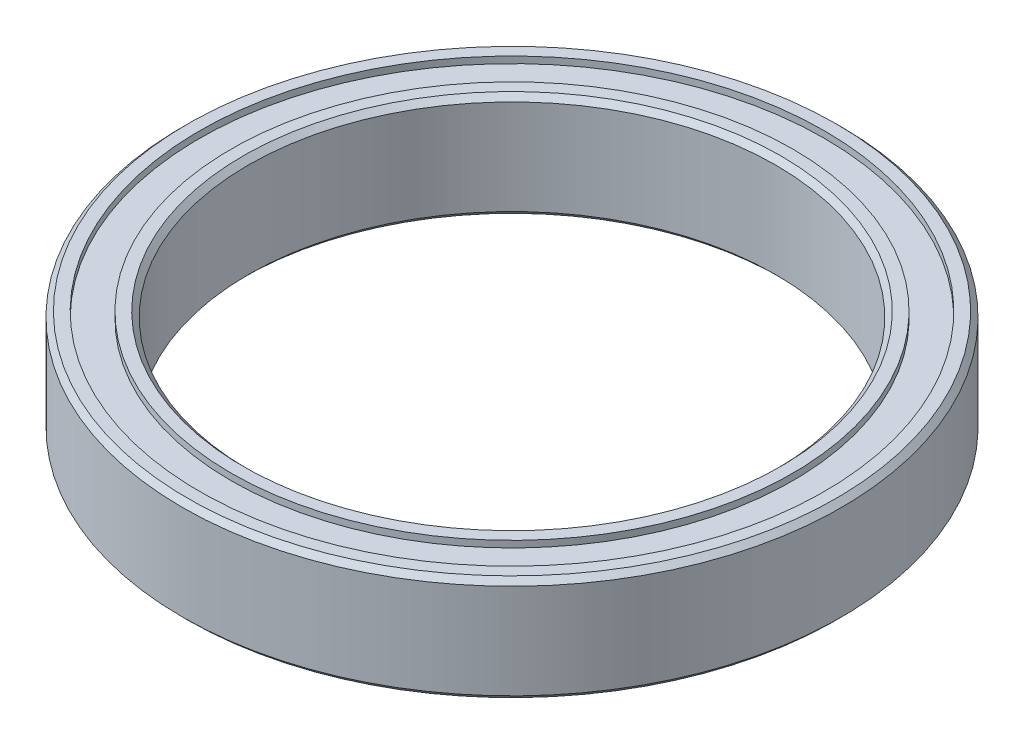
ISO-10303-21;
HEADER;
FILE_DESCRIPTION(('STEP AP214'),'2;1');
FILE_NAME('part.step','',(''),(''),'','','');
FILE_SCHEMA(('AUTOMOTIVE_DESIGN { 1 0 10303 214 1 1 1 1 }'));
ENDSEC;
DATA;
#1=APPLICATION_CONTEXT('core data for automotive mechanical design processes');
#2=APPLICATION_PROTOCOL_DEFINITION('international standard','automotive_design',2000,#1);
#3=PRODUCT_CONTEXT('',#1,'mechanical');
#4=PRODUCT('Part','Part','',(#3));
#5=PRODUCT_RELATED_PRODUCT_CATEGORY('part','',(#4));
#6=PRODUCT_DEFINITION_FORMATION('','',#4);
#7=PRODUCT_DEFINITION_CONTEXT('part definition',#1,'design');
#8=PRODUCT_DEFINITION('design','',#6,#7);
#9=PRODUCT_DEFINITION_SHAPE('','',#8);
#10=(LENGTH_UNIT() NAMED_UNIT(*) SI_UNIT(.MILLI.,.METRE.));
#11=(NAMED_UNIT(*) PLANE_ANGLE_UNIT() SI_UNIT($,.RADIAN.));
#12=(NAMED_UNIT(*) SI_UNIT($,.STERADIAN.) SOLID_ANGLE_UNIT());
#13=UNCERTAINTY_MEASURE_WITH_UNIT(LENGTH_MEASURE(1.E-05),#10,'distance_accuracy_value','');
#14=(GEOMETRIC_REPRESENTATION_CONTEXT(3) GLOBAL_UNCERTAINTY_ASSIGNED_CONTEXT((#13)) GLOBAL_UNIT_ASSIGNED_CONTEXT((#10,
#11,#12)) REPRESENTATION_CONTEXT('',''));
#15=CARTESIAN_POINT('',(0.,0.,0.));
#16=DIRECTION('',(0.,0.,1.));
#17=DIRECTION('',(1.,0.,0.));
#18=AXIS2_PLACEMENT_3D('',#15,#16,#17);
#19=CARTESIAN_POINT('',(0.,-2.,12.5));
#20=DIRECTION('',(0.,1.,0.));
#21=DIRECTION('',(0.,0.,1.));
#22=AXIS2_PLACEMENT_3D('',#19,#20,#21);
#23=PLANE('',#22);
#24=CARTESIAN_POINT('',(0.,-2.,0.));
#25=DIRECTION('',(0.,1.,0.));
#26=DIRECTION('',(0.,0.,1.));
#27=AXIS2_PLACEMENT_3D('',#24,#25,#26);
#28=CIRCLE('',#27,12.3);
#29=CARTESIAN_POINT('',(0.,-2.,12.3));
#30=VERTEX_POINT('',#29);
#31=EDGE_CURVE('E10',#30,#30,#28,.F.);
#32=ORIENTED_EDGE('',*,*,#31,.T.);
#33=EDGE_LOOP('',(#32));
#34=FACE_BOUND('',#33,.T.);
#35=CARTESIAN_POINT('',(0.,-2.,0.));
#36=DIRECTION('',(0.,-1.,0.));
#37=DIRECTION('',(0.,0.,-1.));
#38=AXIS2_PLACEMENT_3D('',#35,#36,#37);
#39=CIRCLE('',#38,11.85);
#40=CARTESIAN_POINT('',(0.,-2.,-11.85));
#41=VERTEX_POINT('',#40);
#42=EDGE_CURVE('E66',#41,#41,#39,.T.);
#43=ORIENTED_EDGE('',*,*,#42,.F.);
#44=EDGE_LOOP('',(#43));
#45=FACE_BOUND('',#44,.T.);
#46=ADVANCED_FACE('F34',(#34,#45),#23,.F.);
#47=CARTESIAN_POINT('',(0.,-18.1229138650565,0.));
#48=DIRECTION('',(0.,-1.,0.));
#49=DIRECTION('',(0.,0.,-1.));
#50=AXIS2_PLACEMENT_3D('',#47,#48,#49);
#51=CYLINDRICAL_SURFACE('',#50,11.85);
#52=CARTESIAN_POINT('',(0.,-1.75,0.));
#53=DIRECTION('',(0.,-1.,0.));
#54=DIRECTION('',(0.,0.,-1.));
#55=AXIS2_PLACEMENT_3D('',#52,#53,#54);
#56=CIRCLE('',#55,11.85);
#57=CARTESIAN_POINT('',(0.,-1.75,-11.85));
#58=VERTEX_POINT('',#57);
#59=EDGE_CURVE('E69',#58,#58,#56,.T.);
#60=ORIENTED_EDGE('',*,*,#59,.F.);
#61=EDGE_LOOP('',(#60));
#62=FACE_BOUND('',#61,.T.);
#63=ORIENTED_EDGE('',*,*,#42,.T.);
#64=EDGE_LOOP('',(#63));
#65=FACE_BOUND('',#64,.T.);
#66=ADVANCED_FACE('F123',(#62,#65),#51,.F.);
#67=CARTESIAN_POINT('',(0.,-1.75,11.85));
#68=DIRECTION('',(0.,1.,0.));
#69=DIRECTION('',(0.,0.,1.));
#70=AXIS2_PLACEMENT_3D('',#67,#68,#69);
#71=PLANE('',#70);
#72=CARTESIAN_POINT('',(0.,-1.75,0.));
#73=DIRECTION('',(0.,-1.,0.));
#74=DIRECTION('',(0.,0.,-1.));
#75=AXIS2_PLACEMENT_3D('',#72,#73,#74);
#76=CIRCLE('',#75,10.65);
#77=CARTESIAN_POINT('',(0.,-1.75,-10.65));
#78=VERTEX_POINT('',#77);
#79=EDGE_CURVE('E72',#78,#78,#76,.T.);
#80=ORIENTED_EDGE('',*,*,#79,.F.);
#81=EDGE_LOOP('',(#80));
#82=FACE_BOUND('',#81,.T.);
#83=ORIENTED_EDGE('',*,*,#59,.T.);
#84=EDGE_LOOP('',(#83));
#85=FACE_BOUND('',#84,.T.);
#86=ADVANCED_FACE('F128',(#82,#85),#71,.F.);
#87=CARTESIAN_POINT('',(0.,-18.1229138650565,0.));
#88=DIRECTION('',(0.,-1.,0.));
#89=DIRECTION('',(0.,0.,-1.));
#90=AXIS2_PLACEMENT_3D('',#87,#88,#89);
#91=CYLINDRICAL_SURFACE('',#90,10.65);
#92=CARTESIAN_POINT('',(0.,-2.,0.));
#93=DIRECTION('',(0.,-1.,0.));
#94=DIRECTION('',(0.,0.,-1.));
#95=AXIS2_PLACEMENT_3D('',#92,#93,#94);
#96=CIRCLE('',#95,10.65);
#97=CARTESIAN_POINT('',(0.,-2.,-10.65));
#98=VERTEX_POINT('',#97);
#99=EDGE_CURVE('E75',#98,#98,#96,.T.);
#100=ORIENTED_EDGE('',*,*,#99,.F.);
#101=EDGE_LOOP('',(#100));
#102=FACE_BOUND('',#101,.T.);
#103=ORIENTED_EDGE('',*,*,#79,.T.);
#104=EDGE_LOOP('',(#103));
#105=FACE_BOUND('',#104,.T.);
#106=ADVANCED_FACE('F181',(#102,#105),#91,.T.);
#107=CARTESIAN_POINT('',(0.,-2.,10.65));
#108=DIRECTION('',(0.,1.,0.));
#109=DIRECTION('',(0.,0.,1.));
#110=AXIS2_PLACEMENT_3D('',#107,#108,#109);
#111=PLANE('',#110);
#112=CARTESIAN_POINT('',(0.,-2.,0.));
#113=DIRECTION('',(0.,1.,0.));
#114=DIRECTION('',(0.,0.,1.));
#115=AXIS2_PLACEMENT_3D('',#112,#113,#114);
#116=CIRCLE('',#115,10.2);
#117=CARTESIAN_POINT('',(0.,-2.,10.2));
#118=VERTEX_POINT('',#117);
#119=EDGE_CURVE('E54',#118,#118,#116,.T.);
#120=ORIENTED_EDGE('',*,*,#119,.T.);
#121=EDGE_LOOP('',(#120));
#122=FACE_BOUND('',#121,.T.);
#123=ORIENTED_EDGE('',*,*,#99,.T.);
#124=EDGE_LOOP('',(#123));
#125=FACE_BOUND('',#124,.T.);
#126=ADVANCED_FACE('F119',(#122,#125),#111,.F.);
#127=CARTESIAN_POINT('',(0.,-18.1229138650565,0.));
#128=DIRECTION('',(0.,-1.,0.));
#129=DIRECTION('',(0.,0.,-1.));
#130=AXIS2_PLACEMENT_3D('',#127,#128,#129);
#131=CYLINDRICAL_SURFACE('',#130,10.);
#132=CARTESIAN_POINT('',(0.,1.8,0.));
#133=DIRECTION('',(0.,-1.,0.));
#134=DIRECTION('',(0.,0.,-1.));
#135=AXIS2_PLACEMENT_3D('',#132,#133,#134);
#136=CIRCLE('',#135,10.);
#137=CARTESIAN_POINT('',(0.,1.8,-10.));
#138=VERTEX_POINT('',#137);
#139=EDGE_CURVE('E57',#138,#138,#136,.F.);
#140=ORIENTED_EDGE('',*,*,#139,.T.);
#141=EDGE_LOOP('',(#140));
#142=FACE_BOUND('',#141,.T.);
#143=CARTESIAN_POINT('',(0.,-1.80000000000002,0.));
#144=DIRECTION('',(0.,1.,0.));
#145=DIRECTION('',(0.,0.,1.));
#146=AXIS2_PLACEMENT_3D('',#143,#144,#145);
#147=CIRCLE('',#146,10.);
#148=CARTESIAN_POINT('',(0.,-1.80000000000002,10.));
#149=VERTEX_POINT('',#148);
#150=EDGE_CURVE('E60',#149,#149,#147,.F.);
#151=ORIENTED_EDGE('',*,*,#150,.T.);
#152=EDGE_LOOP('',(#151));
#153=FACE_BOUND('',#152,.T.);
#154=ADVANCED_FACE('F113',(#142,#153),#131,.F.);
#155=CARTESIAN_POINT('',(0.,2.,10.65));
#156=DIRECTION('',(0.,-1.,0.));
#157=DIRECTION('',(0.,0.,-1.));
#158=AXIS2_PLACEMENT_3D('',#155,#156,#157);
#159=PLANE('',#158);
#160=CARTESIAN_POINT('',(0.,2.,0.));
#161=DIRECTION('',(0.,-1.,0.));
#162=DIRECTION('',(0.,0.,-1.));
#163=AXIS2_PLACEMENT_3D('',#160,#161,#162);
#164=CIRCLE('',#163,10.2);
#165=CARTESIAN_POINT('',(0.,2.,-10.2));
#166=VERTEX_POINT('',#165);
#167=EDGE_CURVE('E63',#166,#166,#164,.T.);
#168=ORIENTED_EDGE('',*,*,#167,.T.);
#169=EDGE_LOOP('',(#168));
#170=FACE_BOUND('',#169,.T.);
#171=CARTESIAN_POINT('',(0.,2.,0.));
#172=DIRECTION('',(0.,-1.,0.));
#173=DIRECTION('',(0.,0.,-1.));
#174=AXIS2_PLACEMENT_3D('',#171,#172,#173);
#175=CIRCLE('',#174,10.65);
#176=CARTESIAN_POINT('',(0.,2.,-10.65));
#177=VERTEX_POINT('',#176);
#178=EDGE_CURVE('E78',#177,#177,#175,.T.);
#179=ORIENTED_EDGE('',*,*,#178,.F.);
#180=EDGE_LOOP('',(#179));
#181=FACE_BOUND('',#180,.T.);
#182=ADVANCED_FACE('F108',(#170,#181),#159,.F.);
#183=CARTESIAN_POINT('',(0.,-18.1229138650565,0.));
#184=DIRECTION('',(0.,-1.,0.));
#185=DIRECTION('',(0.,0.,-1.));
#186=AXIS2_PLACEMENT_3D('',#183,#184,#185);
#187=CYLINDRICAL_SURFACE('',#186,10.65);
#188=CARTESIAN_POINT('',(0.,1.75,0.));
#189=DIRECTION('',(0.,-1.,0.));
#190=DIRECTION('',(0.,0.,-1.));
#191=AXIS2_PLACEMENT_3D('',#188,#189,#190);
#192=CIRCLE('',#191,10.65);
#193=CARTESIAN_POINT('',(0.,1.75,-10.65));
#194=VERTEX_POINT('',#193);
#195=EDGE_CURVE('E81',#194,#194,#192,.T.);
#196=ORIENTED_EDGE('',*,*,#195,.F.);
#197=EDGE_LOOP('',(#196));
#198=FACE_BOUND('',#197,.T.);
#199=ORIENTED_EDGE('',*,*,#178,.T.);
#200=EDGE_LOOP('',(#199));
#201=FACE_BOUND('',#200,.T.);
#202=ADVANCED_FACE('F102',(#198,#201),#187,.T.);
#203=CARTESIAN_POINT('',(0.,1.75,11.85));
#204=DIRECTION('',(0.,-1.,0.));
#205=DIRECTION('',(0.,0.,-1.));
#206=AXIS2_PLACEMENT_3D('',#203,#204,#205);
#207=PLANE('',#206);
#208=CARTESIAN_POINT('',(0.,1.75,0.));
#209=DIRECTION('',(0.,-1.,0.));
#210=DIRECTION('',(0.,0.,-1.));
#211=AXIS2_PLACEMENT_3D('',#208,#209,#210);
#212=CIRCLE('',#211,11.85);
#213=CARTESIAN_POINT('',(0.,1.75,-11.85));
#214=VERTEX_POINT('',#213);
#215=EDGE_CURVE('E84',#214,#214,#212,.T.);
#216=ORIENTED_EDGE('',*,*,#215,.F.);
#217=EDGE_LOOP('',(#216));
#218=FACE_BOUND('',#217,.T.);
#219=ORIENTED_EDGE('',*,*,#195,.T.);
#220=EDGE_LOOP('',(#219));
#221=FACE_BOUND('',#220,.T.);
#222=ADVANCED_FACE('F96',(#218,#221),#207,.F.);
#223=CARTESIAN_POINT('',(0.,-18.1229138650565,0.));
#224=DIRECTION('',(0.,-1.,0.));
#225=DIRECTION('',(0.,0.,-1.));
#226=AXIS2_PLACEMENT_3D('',#223,#224,#225);
#227=CYLINDRICAL_SURFACE('',#226,11.85);
#228=CARTESIAN_POINT('',(0.,2.,0.));
#229=DIRECTION('',(0.,-1.,0.));
#230=DIRECTION('',(0.,0.,-1.));
#231=AXIS2_PLACEMENT_3D('',#228,#229,#230);
#232=CIRCLE('',#231,11.85);
#233=CARTESIAN_POINT('',(0.,2.,-11.85));
#234=VERTEX_POINT('',#233);
#235=EDGE_CURVE('E87',#234,#234,#232,.T.);
#236=ORIENTED_EDGE('',*,*,#235,.F.);
#237=EDGE_LOOP('',(#236));
#238=FACE_BOUND('',#237,.T.);
#239=ORIENTED_EDGE('',*,*,#215,.T.);
#240=EDGE_LOOP('',(#239));
#241=FACE_BOUND('',#240,.T.);
#242=ADVANCED_FACE('F93',(#238,#241),#227,.F.);
#243=CARTESIAN_POINT('',(0.,2.,12.5));
#244=DIRECTION('',(0.,-1.,0.));
#245=DIRECTION('',(0.,0.,-1.));
#246=AXIS2_PLACEMENT_3D('',#243,#244,#245);
#247=PLANE('',#246);
#248=CARTESIAN_POINT('',(0.,2.,0.));
#249=DIRECTION('',(0.,-1.,0.));
#250=DIRECTION('',(0.,0.,-1.));
#251=AXIS2_PLACEMENT_3D('',#248,#249,#250);
#252=CIRCLE('',#251,12.3);
#253=CARTESIAN_POINT('',(0.,2.,-12.3));
#254=VERTEX_POINT('',#253);
#255=EDGE_CURVE('E41',#254,#254,#252,.F.);
#256=ORIENTED_EDGE('',*,*,#255,.T.);
#257=EDGE_LOOP('',(#256));
#258=FACE_BOUND('',#257,.T.);
#259=ORIENTED_EDGE('',*,*,#235,.T.);
#260=EDGE_LOOP('',(#259));
#261=FACE_BOUND('',#260,.T.);
#262=ADVANCED_FACE('F91',(#258,#261),#247,.F.);
#263=CARTESIAN_POINT('',(0.,-18.1229138650565,0.));
#264=DIRECTION('',(0.,-1.,0.));
#265=DIRECTION('',(0.,0.,-1.));
#266=AXIS2_PLACEMENT_3D('',#263,#264,#265);
#267=CYLINDRICAL_SURFACE('',#266,12.5);
#268=CARTESIAN_POINT('',(0.,1.80000000000001,0.));
#269=DIRECTION('',(0.,-1.,0.));
#270=DIRECTION('',(0.,0.,-1.));
#271=AXIS2_PLACEMENT_3D('',#268,#269,#270);
#272=CIRCLE('',#271,12.5);
#273=CARTESIAN_POINT('',(0.,1.80000000000001,-12.5));
#274=VERTEX_POINT('',#273);
#275=EDGE_CURVE('E45',#274,#274,#272,.T.);
#276=ORIENTED_EDGE('',*,*,#275,.T.);
#277=EDGE_LOOP('',(#276));
#278=FACE_BOUND('',#277,.T.);
#279=CARTESIAN_POINT('',(0.,-1.80000000000001,0.));
#280=DIRECTION('',(0.,1.,0.));
#281=DIRECTION('',(0.,0.,1.));
#282=AXIS2_PLACEMENT_3D('',#279,#280,#281);
#283=CIRCLE('',#282,12.5);
#284=CARTESIAN_POINT('',(0.,-1.80000000000001,12.5));
#285=VERTEX_POINT('',#284);
#286=EDGE_CURVE('E49',#285,#285,#283,.T.);
#287=ORIENTED_EDGE('',*,*,#286,.T.);
#288=EDGE_LOOP('',(#287));
#289=FACE_BOUND('',#288,.T.);
#290=ADVANCED_FACE('F138',(#278,#289),#267,.T.);
#291=CARTESIAN_POINT('',(0.,2.,0.));
#292=DIRECTION('',(0.,1.,0.));
#293=DIRECTION('',(0.,0.,1.));
#294=AXIS2_PLACEMENT_3D('',#291,#292,#293);
#295=CONICAL_SURFACE('',#294,10.2,0.785398163397448);
#296=ORIENTED_EDGE('',*,*,#139,.F.);
#297=EDGE_LOOP('',(#296));
#298=FACE_BOUND('',#297,.T.);
#299=ORIENTED_EDGE('',*,*,#167,.F.);
#300=EDGE_LOOP('',(#299));
#301=FACE_BOUND('',#300,.T.);
#302=ADVANCED_FACE('F134',(#298,#301),#295,.F.);
#303=CARTESIAN_POINT('',(0.,-1.80000000000002,0.));
#304=DIRECTION('',(0.,-1.,0.));
#305=DIRECTION('',(0.,0.,-1.));
#306=AXIS2_PLACEMENT_3D('',#303,#304,#305);
#307=CONICAL_SURFACE('',#306,10.,0.785398163397461);
#308=ORIENTED_EDGE('',*,*,#119,.F.);
#309=EDGE_LOOP('',(#308));
#310=FACE_BOUND('',#309,.T.);
#311=ORIENTED_EDGE('',*,*,#150,.F.);
#312=EDGE_LOOP('',(#311));
#313=FACE_BOUND('',#312,.T.);
#314=ADVANCED_FACE('F137',(#310,#313),#307,.F.);
#315=CARTESIAN_POINT('',(0.,1.80000000000001,0.));
#316=DIRECTION('',(0.,-1.,0.));
#317=DIRECTION('',(0.,0.,-1.));
#318=AXIS2_PLACEMENT_3D('',#315,#316,#317);
#319=CONICAL_SURFACE('',#318,12.5,0.785398163397448);
#320=ORIENTED_EDGE('',*,*,#255,.F.);
#321=EDGE_LOOP('',(#320));
#322=FACE_BOUND('',#321,.T.);
#323=ORIENTED_EDGE('',*,*,#275,.F.);
#324=EDGE_LOOP('',(#323));
#325=FACE_BOUND('',#324,.T.);
#326=ADVANCED_FACE('F141',(#322,#325),#319,.T.);
#327=CARTESIAN_POINT('',(0.,-2.,0.));
#328=DIRECTION('',(0.,1.,0.));
#329=DIRECTION('',(0.,0.,1.));
#330=AXIS2_PLACEMENT_3D('',#327,#328,#329);
#331=CONICAL_SURFACE('',#330,12.3,0.785398163397448);
#332=ORIENTED_EDGE('',*,*,#286,.F.);
#333=EDGE_LOOP('',(#332));
#334=FACE_BOUND('',#333,.T.);
#335=ORIENTED_EDGE('',*,*,#31,.F.);
#336=EDGE_LOOP('',(#335));
#337=FACE_BOUND('',#336,.T.);
#338=ADVANCED_FACE('F36',(#334,#337),#331,.T.);
#339=CLOSED_SHELL('',(#46,#66,#86,#106,#126,#154,#182,#202,#222,#242,#262,#290,#302,#314,#326,#338));
#340=MANIFOLD_SOLID_BREP('B2',#339);
#341=ADVANCED_BREP_SHAPE_REPRESENTATION('',(#18,#340),#14);
#342=SHAPE_DEFINITION_REPRESENTATION(#9,#341);
ENDSEC;
END-ISO-10303-21;
